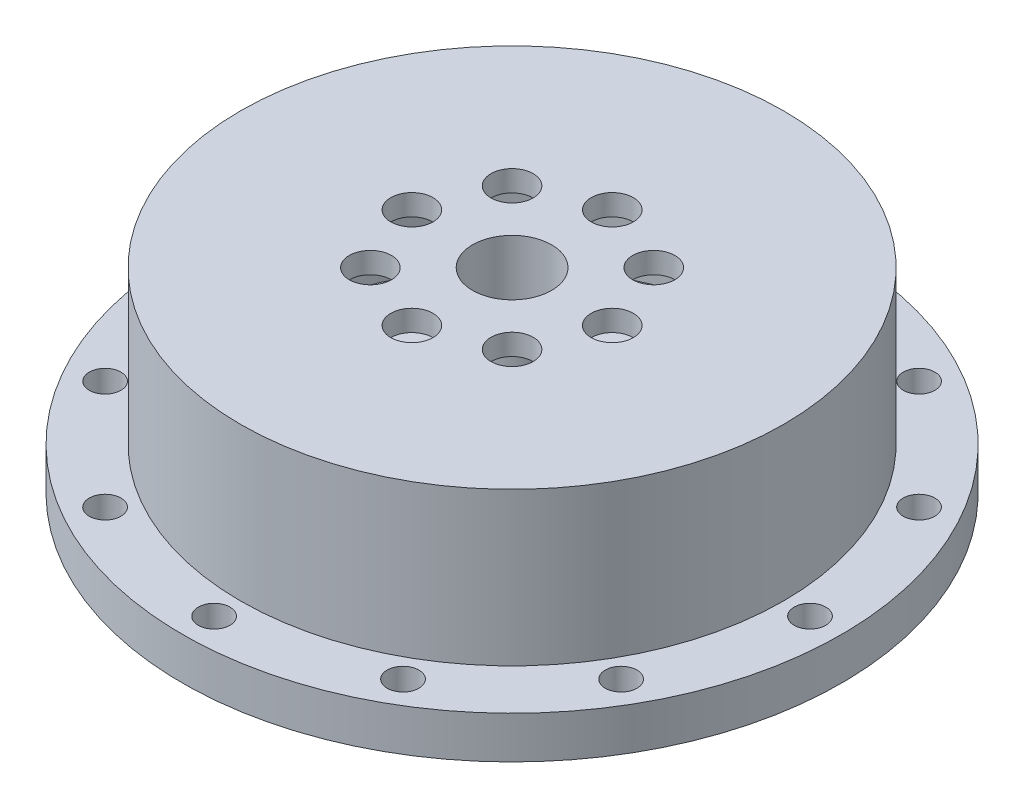
ISO-10303-21;
HEADER;
FILE_DESCRIPTION(('STEP AP214'),'2;1');
FILE_NAME('part.step','',(''),(''),'','','');
FILE_SCHEMA(('AUTOMOTIVE_DESIGN { 1 0 10303 214 1 1 1 1 }'));
ENDSEC;
DATA;
#1=APPLICATION_CONTEXT('core data for automotive mechanical design processes');
#2=APPLICATION_PROTOCOL_DEFINITION('international standard','automotive_design',2000,#1);
#3=PRODUCT_CONTEXT('',#1,'mechanical');
#4=PRODUCT('Part','Part','',(#3));
#5=PRODUCT_RELATED_PRODUCT_CATEGORY('part','',(#4));
#6=PRODUCT_DEFINITION_FORMATION('','',#4);
#7=PRODUCT_DEFINITION_CONTEXT('part definition',#1,'design');
#8=PRODUCT_DEFINITION('design','',#6,#7);
#9=PRODUCT_DEFINITION_SHAPE('','',#8);
#10=(LENGTH_UNIT() NAMED_UNIT(*) SI_UNIT(.MILLI.,.METRE.));
#11=(NAMED_UNIT(*) PLANE_ANGLE_UNIT() SI_UNIT($,.RADIAN.));
#12=(NAMED_UNIT(*) SI_UNIT($,.STERADIAN.) SOLID_ANGLE_UNIT());
#13=UNCERTAINTY_MEASURE_WITH_UNIT(LENGTH_MEASURE(1.E-05),#10,'distance_accuracy_value','');
#14=(GEOMETRIC_REPRESENTATION_CONTEXT(3) GLOBAL_UNCERTAINTY_ASSIGNED_CONTEXT((#13)) GLOBAL_UNIT_ASSIGNED_CONTEXT((#10,
#11,#12)) REPRESENTATION_CONTEXT('',''));
#15=CARTESIAN_POINT('',(0.,0.,0.));
#16=DIRECTION('',(0.,0.,1.));
#17=DIRECTION('',(1.,0.,0.));
#18=AXIS2_PLACEMENT_3D('',#15,#16,#17);
#19=CARTESIAN_POINT('',(7.5,32.2161096228833,0.));
#20=DIRECTION('',(0.,-1.,0.));
#21=DIRECTION('',(0.,0.,-1.));
#22=AXIS2_PLACEMENT_3D('',#19,#20,#21);
#23=PLANE('',#22);
#24=CARTESIAN_POINT('',(0.,32.2161096228833,0.));
#25=DIRECTION('',(0.,-1.,0.));
#26=DIRECTION('',(0.,0.,-1.));
#27=AXIS2_PLACEMENT_3D('',#24,#25,#26);
#28=CIRCLE('',#27,10.5);
#29=CARTESIAN_POINT('',(0.,32.2161096228833,-10.5));
#30=VERTEX_POINT('',#29);
#31=EDGE_CURVE('E11',#30,#30,#28,.T.);
#32=ORIENTED_EDGE('',*,*,#31,.T.);
#33=EDGE_LOOP('',(#32));
#34=FACE_BOUND('',#33,.T.);
#35=CARTESIAN_POINT('',(0.,32.2161096228833,0.));
#36=DIRECTION('',(0.,-1.,0.));
#37=DIRECTION('',(0.,0.,-1.));
#38=AXIS2_PLACEMENT_3D('',#35,#36,#37);
#39=CIRCLE('',#38,7.5);
#40=CARTESIAN_POINT('',(0.,32.2161096228833,-7.5));
#41=VERTEX_POINT('',#40);
#42=EDGE_CURVE('E232',#41,#41,#39,.T.);
#43=ORIENTED_EDGE('',*,*,#42,.F.);
#44=EDGE_LOOP('',(#43));
#45=FACE_BOUND('',#44,.T.);
#46=ADVANCED_FACE('F38',(#34,#45),#23,.T.);
#47=CARTESIAN_POINT('',(0.,0.,0.));
#48=DIRECTION('',(0.,-1.,0.));
#49=DIRECTION('',(0.,0.,-1.));
#50=AXIS2_PLACEMENT_3D('',#47,#48,#49);
#51=CYLINDRICAL_SURFACE('',#50,10.5);
#52=CARTESIAN_POINT('',(0.,39.2161096228833,0.));
#53=DIRECTION('',(0.,-1.,0.));
#54=DIRECTION('',(0.,0.,-1.));
#55=AXIS2_PLACEMENT_3D('',#52,#53,#54);
#56=CIRCLE('',#55,10.5);
#57=CARTESIAN_POINT('',(0.,39.2161096228833,-10.5));
#58=VERTEX_POINT('',#57);
#59=EDGE_CURVE('E45',#58,#58,#56,.T.);
#60=ORIENTED_EDGE('',*,*,#59,.T.);
#61=EDGE_LOOP('',(#60));
#62=FACE_BOUND('',#61,.T.);
#63=ORIENTED_EDGE('',*,*,#31,.F.);
#64=EDGE_LOOP('',(#63));
#65=FACE_BOUND('',#64,.T.);
#66=ADVANCED_FACE('F279',(#62,#65),#51,.T.);
#67=CARTESIAN_POINT('',(10.5,39.2161096228833,0.));
#68=DIRECTION('',(0.,-1.,0.));
#69=DIRECTION('',(0.,0.,-1.));
#70=AXIS2_PLACEMENT_3D('',#67,#68,#69);
#71=PLANE('',#70);
#72=CARTESIAN_POINT('',(13.4350288425444,39.2161096228833,-13.4350288425444));
#73=DIRECTION('',(0.,-1.,0.));
#74=DIRECTION('',(0.,0.,-1.));
#75=AXIS2_PLACEMENT_3D('',#72,#73,#74);
#76=CIRCLE('',#75,4.);
#77=CARTESIAN_POINT('',(13.4350288425444,39.2161096228833,-17.4350288425444));
#78=VERTEX_POINT('',#77);
#79=EDGE_CURVE('E157',#78,#78,#76,.T.);
#80=ORIENTED_EDGE('',*,*,#79,.F.);
#81=EDGE_LOOP('',(#80));
#82=FACE_BOUND('',#81,.T.);
#83=CARTESIAN_POINT('',(0.,39.2161096228833,-19.));
#84=DIRECTION('',(0.,-1.,0.));
#85=DIRECTION('',(0.,0.,-1.));
#86=AXIS2_PLACEMENT_3D('',#83,#84,#85);
#87=CIRCLE('',#86,4.);
#88=CARTESIAN_POINT('',(0.,39.2161096228833,-23.));
#89=VERTEX_POINT('',#88);
#90=EDGE_CURVE('E154',#89,#89,#87,.T.);
#91=ORIENTED_EDGE('',*,*,#90,.F.);
#92=EDGE_LOOP('',(#91));
#93=FACE_BOUND('',#92,.T.);
#94=CARTESIAN_POINT('',(-13.4350288425444,39.2161096228833,-13.4350288425444));
#95=DIRECTION('',(0.,-1.,0.));
#96=DIRECTION('',(0.,0.,-1.));
#97=AXIS2_PLACEMENT_3D('',#94,#95,#96);
#98=CIRCLE('',#97,4.);
#99=CARTESIAN_POINT('',(-13.4350288425444,39.2161096228833,-17.4350288425444));
#100=VERTEX_POINT('',#99);
#101=EDGE_CURVE('E151',#100,#100,#98,.T.);
#102=ORIENTED_EDGE('',*,*,#101,.F.);
#103=EDGE_LOOP('',(#102));
#104=FACE_BOUND('',#103,.T.);
#105=CARTESIAN_POINT('',(-19.,39.2161096228833,0.));
#106=DIRECTION('',(0.,-1.,0.));
#107=DIRECTION('',(0.,0.,-1.));
#108=AXIS2_PLACEMENT_3D('',#105,#106,#107);
#109=CIRCLE('',#108,4.);
#110=CARTESIAN_POINT('',(-19.,39.2161096228833,-4.));
#111=VERTEX_POINT('',#110);
#112=EDGE_CURVE('E148',#111,#111,#109,.T.);
#113=ORIENTED_EDGE('',*,*,#112,.F.);
#114=EDGE_LOOP('',(#113));
#115=FACE_BOUND('',#114,.T.);
#116=CARTESIAN_POINT('',(-13.4350288425444,39.2161096228833,13.4350288425444));
#117=DIRECTION('',(0.,-1.,0.));
#118=DIRECTION('',(0.,0.,-1.));
#119=AXIS2_PLACEMENT_3D('',#116,#117,#118);
#120=CIRCLE('',#119,4.);
#121=CARTESIAN_POINT('',(-13.4350288425444,39.2161096228833,9.4350288425444));
#122=VERTEX_POINT('',#121);
#123=EDGE_CURVE('E145',#122,#122,#120,.T.);
#124=ORIENTED_EDGE('',*,*,#123,.F.);
#125=EDGE_LOOP('',(#124));
#126=FACE_BOUND('',#125,.T.);
#127=CARTESIAN_POINT('',(0.,39.2161096228833,19.));
#128=DIRECTION('',(0.,-1.,0.));
#129=DIRECTION('',(0.,0.,-1.));
#130=AXIS2_PLACEMENT_3D('',#127,#128,#129);
#131=CIRCLE('',#130,4.);
#132=CARTESIAN_POINT('',(0.,39.2161096228833,15.));
#133=VERTEX_POINT('',#132);
#134=EDGE_CURVE('E142',#133,#133,#131,.T.);
#135=ORIENTED_EDGE('',*,*,#134,.F.);
#136=EDGE_LOOP('',(#135));
#137=FACE_BOUND('',#136,.T.);
#138=CARTESIAN_POINT('',(13.4350288425444,39.2161096228833,13.4350288425444));
#139=DIRECTION('',(0.,-1.,0.));
#140=DIRECTION('',(0.,0.,-1.));
#141=AXIS2_PLACEMENT_3D('',#138,#139,#140);
#142=CIRCLE('',#141,4.);
#143=CARTESIAN_POINT('',(13.4350288425444,39.2161096228833,9.43502884254441));
#144=VERTEX_POINT('',#143);
#145=EDGE_CURVE('E139',#144,#144,#142,.T.);
#146=ORIENTED_EDGE('',*,*,#145,.F.);
#147=EDGE_LOOP('',(#146));
#148=FACE_BOUND('',#147,.T.);
#149=CARTESIAN_POINT('',(19.,39.2161096228833,0.));
#150=DIRECTION('',(0.,-1.,0.));
#151=DIRECTION('',(0.,0.,-1.));
#152=AXIS2_PLACEMENT_3D('',#149,#150,#151);
#153=CIRCLE('',#152,4.);
#154=CARTESIAN_POINT('',(19.,39.2161096228833,-4.));
#155=VERTEX_POINT('',#154);
#156=EDGE_CURVE('E136',#155,#155,#153,.T.);
#157=ORIENTED_EDGE('',*,*,#156,.F.);
#158=EDGE_LOOP('',(#157));
#159=FACE_BOUND('',#158,.T.);
#160=CARTESIAN_POINT('',(0.,39.2161096228833,0.));
#161=DIRECTION('',(0.,-1.,0.));
#162=DIRECTION('',(0.,0.,-1.));
#163=AXIS2_PLACEMENT_3D('',#160,#161,#162);
#164=CIRCLE('',#163,48.);
#165=CARTESIAN_POINT('',(0.,39.2161096228833,-48.));
#166=VERTEX_POINT('',#165);
#167=EDGE_CURVE('E274',#166,#166,#164,.T.);
#168=ORIENTED_EDGE('',*,*,#167,.T.);
#169=EDGE_LOOP('',(#168));
#170=FACE_BOUND('',#169,.T.);
#171=ORIENTED_EDGE('',*,*,#59,.F.);
#172=EDGE_LOOP('',(#171));
#173=FACE_BOUND('',#172,.T.);
#174=ADVANCED_FACE('F282',(#82,#93,#104,#115,#126,#137,#148,#159,#170,#173),#71,.T.);
#175=CARTESIAN_POINT('',(0.,0.,0.));
#176=DIRECTION('',(0.,-1.,0.));
#177=DIRECTION('',(0.,0.,-1.));
#178=AXIS2_PLACEMENT_3D('',#175,#176,#177);
#179=CYLINDRICAL_SURFACE('',#178,48.);
#180=CARTESIAN_POINT('',(0.,9.21610962288333,0.));
#181=DIRECTION('',(0.,-1.,0.));
#182=DIRECTION('',(0.,0.,-1.));
#183=AXIS2_PLACEMENT_3D('',#180,#181,#182);
#184=CIRCLE('',#183,48.);
#185=CARTESIAN_POINT('',(0.,9.21610962288333,-48.));
#186=VERTEX_POINT('',#185);
#187=EDGE_CURVE('E271',#186,#186,#184,.T.);
#188=ORIENTED_EDGE('',*,*,#187,.T.);
#189=EDGE_LOOP('',(#188));
#190=FACE_BOUND('',#189,.T.);
#191=ORIENTED_EDGE('',*,*,#167,.F.);
#192=EDGE_LOOP('',(#191));
#193=FACE_BOUND('',#192,.T.);
#194=ADVANCED_FACE('F284',(#190,#193),#179,.F.);
#195=CARTESIAN_POINT('',(48.,9.21610962288333,0.));
#196=DIRECTION('',(0.,1.,0.));
#197=DIRECTION('',(0.,0.,1.));
#198=AXIS2_PLACEMENT_3D('',#195,#196,#197);
#199=PLANE('',#198);
#200=CARTESIAN_POINT('',(0.,9.21610962288333,0.));
#201=DIRECTION('',(0.,-1.,0.));
#202=DIRECTION('',(0.,0.,-1.));
#203=AXIS2_PLACEMENT_3D('',#200,#201,#202);
#204=CIRCLE('',#203,7.5);
#205=CARTESIAN_POINT('',(-1.00000000000039,9.21610962288333,7.4330343736592));
#206=VERTEX_POINT('',#205);
#207=CARTESIAN_POINT('',(0.999999999999613,9.21610962288333,7.4330343736593));
#208=VERTEX_POINT('',#207);
#209=EDGE_CURVE('E85',#206,#208,#204,.T.);
#210=ORIENTED_EDGE('',*,*,#209,.T.);
#211=DIRECTION('',(0.,0.,1.));
#212=VECTOR('',#211,1.);
#213=CARTESIAN_POINT('',(0.999999999999613,9.21610962288333,9.00000000000054));
#214=LINE('',#213,#212);
#215=CARTESIAN_POINT('',(0.999999999999613,9.21610962288333,6.00000000000054));
#216=VERTEX_POINT('',#215);
#217=EDGE_CURVE('E77',#216,#208,#214,.T.);
#218=ORIENTED_EDGE('',*,*,#217,.F.);
#219=DIRECTION('',(1.,0.,0.));
#220=VECTOR('',#219,1.);
#221=CARTESIAN_POINT('',(0.999999999999613,9.21610962288333,6.00000000000054));
#222=LINE('',#221,#220);
#223=CARTESIAN_POINT('',(-1.00000000000039,9.21610962288333,6.00000000000054));
#224=VERTEX_POINT('',#223);
#225=EDGE_CURVE('E83',#224,#216,#222,.T.);
#226=ORIENTED_EDGE('',*,*,#225,.F.);
#227=DIRECTION('',(0.,0.,-1.));
#228=VECTOR('',#227,1.);
#229=CARTESIAN_POINT('',(-1.00000000000039,9.21610962288333,9.00000000000054));
#230=LINE('',#229,#228);
#231=EDGE_CURVE('E87',#206,#224,#230,.T.);
#232=ORIENTED_EDGE('',*,*,#231,.F.);
#233=EDGE_LOOP('',(#210,#218,#226,#232));
#234=FACE_BOUND('',#233,.T.);
#235=ORIENTED_EDGE('',*,*,#187,.F.);
#236=EDGE_LOOP('',(#235));
#237=FACE_BOUND('',#236,.T.);
#238=ADVANCED_FACE('F79',(#234,#237),#199,.T.);
#239=CARTESIAN_POINT('',(0.,0.,0.));
#240=DIRECTION('',(0.,-1.,0.));
#241=DIRECTION('',(0.,0.,-1.));
#242=AXIS2_PLACEMENT_3D('',#239,#240,#241);
#243=CYLINDRICAL_SURFACE('',#242,7.5);
#244=DIRECTION('',(0.,-1.,0.));
#245=VECTOR('',#244,1.);
#246=CARTESIAN_POINT('',(0.999999999999613,0.,7.4330343736593));
#247=LINE('',#246,#245);
#248=CARTESIAN_POINT('',(0.999999999999612,3.21610962288333,7.4330343736593));
#249=VERTEX_POINT('',#248);
#250=EDGE_CURVE('E52',#208,#249,#247,.T.);
#251=ORIENTED_EDGE('',*,*,#250,.F.);
#252=ORIENTED_EDGE('',*,*,#209,.F.);
#253=DIRECTION('',(0.,-1.,0.));
#254=VECTOR('',#253,1.);
#255=CARTESIAN_POINT('',(-1.00000000000039,0.,7.4330343736592));
#256=LINE('',#255,#254);
#257=CARTESIAN_POINT('',(-1.00000000000039,3.21610962288333,7.4330343736592));
#258=VERTEX_POINT('',#257);
#259=EDGE_CURVE('E57',#258,#206,#256,.F.);
#260=ORIENTED_EDGE('',*,*,#259,.F.);
#261=CARTESIAN_POINT('',(0.,3.21610962288333,0.));
#262=DIRECTION('',(0.,-1.,0.));
#263=DIRECTION('',(0.,0.,-1.));
#264=AXIS2_PLACEMENT_3D('',#261,#262,#263);
#265=CIRCLE('',#264,7.5);
#266=EDGE_CURVE('E268',#258,#249,#265,.T.);
#267=ORIENTED_EDGE('',*,*,#266,.T.);
#268=EDGE_LOOP('',(#251,#252,#260,#267));
#269=FACE_BOUND('',#268,.T.);
#270=ADVANCED_FACE('F375',(#269),#243,.F.);
#271=CARTESIAN_POINT('',(10.,3.21610962288333,0.));
#272=DIRECTION('',(0.,-1.,0.));
#273=DIRECTION('',(0.,0.,-1.));
#274=AXIS2_PLACEMENT_3D('',#271,#272,#273);
#275=PLANE('',#274);
#276=ORIENTED_EDGE('',*,*,#266,.F.);
#277=DIRECTION('',(0.,0.,-1.));
#278=VECTOR('',#277,1.);
#279=CARTESIAN_POINT('',(-1.00000000000039,3.21610962288333,9.00000000000054));
#280=LINE('',#279,#278);
#281=CARTESIAN_POINT('',(-1.00000000000039,3.21610962288333,6.00000000000054));
#282=VERTEX_POINT('',#281);
#283=EDGE_CURVE('E106',#258,#282,#280,.T.);
#284=ORIENTED_EDGE('',*,*,#283,.T.);
#285=DIRECTION('',(1.,0.,0.));
#286=VECTOR('',#285,1.);
#287=CARTESIAN_POINT('',(0.999999999999613,3.21610962288333,6.00000000000054));
#288=LINE('',#287,#286);
#289=CARTESIAN_POINT('',(0.999999999999613,3.21610962288333,6.00000000000054));
#290=VERTEX_POINT('',#289);
#291=EDGE_CURVE('E102',#282,#290,#288,.T.);
#292=ORIENTED_EDGE('',*,*,#291,.T.);
#293=DIRECTION('',(0.,0.,1.));
#294=VECTOR('',#293,1.);
#295=CARTESIAN_POINT('',(0.999999999999613,3.21610962288333,9.00000000000054));
#296=LINE('',#295,#294);
#297=EDGE_CURVE('E93',#290,#249,#296,.T.);
#298=ORIENTED_EDGE('',*,*,#297,.T.);
#299=EDGE_LOOP('',(#276,#284,#292,#298));
#300=FACE_BOUND('',#299,.T.);
#301=CARTESIAN_POINT('',(0.,3.21610962288333,0.));
#302=DIRECTION('',(0.,-1.,0.));
#303=DIRECTION('',(0.,0.,-1.));
#304=AXIS2_PLACEMENT_3D('',#301,#302,#303);
#305=CIRCLE('',#304,10.);
#306=CARTESIAN_POINT('',(0.,3.21610962288333,-10.));
#307=VERTEX_POINT('',#306);
#308=EDGE_CURVE('E265',#307,#307,#305,.T.);
#309=ORIENTED_EDGE('',*,*,#308,.T.);
#310=EDGE_LOOP('',(#309));
#311=FACE_BOUND('',#310,.T.);
#312=ADVANCED_FACE('F370',(#300,#311),#275,.T.);
#313=CARTESIAN_POINT('',(0.,0.,0.));
#314=DIRECTION('',(0.,-1.,0.));
#315=DIRECTION('',(0.,0.,-1.));
#316=AXIS2_PLACEMENT_3D('',#313,#314,#315);
#317=CYLINDRICAL_SURFACE('',#316,10.);
#318=CARTESIAN_POINT('',(0.,6.21610962288333,0.));
#319=DIRECTION('',(0.,-1.,0.));
#320=DIRECTION('',(0.,0.,-1.));
#321=AXIS2_PLACEMENT_3D('',#318,#319,#320);
#322=CIRCLE('',#321,10.);
#323=CARTESIAN_POINT('',(0.,6.21610962288333,-10.));
#324=VERTEX_POINT('',#323);
#325=EDGE_CURVE('E262',#324,#324,#322,.T.);
#326=ORIENTED_EDGE('',*,*,#325,.T.);
#327=EDGE_LOOP('',(#326));
#328=FACE_BOUND('',#327,.T.);
#329=ORIENTED_EDGE('',*,*,#308,.F.);
#330=EDGE_LOOP('',(#329));
#331=FACE_BOUND('',#330,.T.);
#332=ADVANCED_FACE('F364',(#328,#331),#317,.T.);
#333=CARTESIAN_POINT('',(36.,6.21610962288334,0.));
#334=DIRECTION('',(0.,-1.,0.));
#335=DIRECTION('',(0.,0.,-1.));
#336=AXIS2_PLACEMENT_3D('',#333,#334,#335);
#337=PLANE('',#336);
#338=CARTESIAN_POINT('',(0.,6.21610962288334,0.));
#339=DIRECTION('',(0.,-1.,0.));
#340=DIRECTION('',(0.,0.,-1.));
#341=AXIS2_PLACEMENT_3D('',#338,#339,#340);
#342=CIRCLE('',#341,36.);
#343=CARTESIAN_POINT('',(0.,6.21610962288334,-36.));
#344=VERTEX_POINT('',#343);
#345=EDGE_CURVE('E259',#344,#344,#342,.T.);
#346=ORIENTED_EDGE('',*,*,#345,.T.);
#347=EDGE_LOOP('',(#346));
#348=FACE_BOUND('',#347,.T.);
#349=ORIENTED_EDGE('',*,*,#325,.F.);
#350=EDGE_LOOP('',(#349));
#351=FACE_BOUND('',#350,.T.);
#352=ADVANCED_FACE('F358',(#348,#351),#337,.T.);
#353=CARTESIAN_POINT('',(0.,0.,0.));
#354=DIRECTION('',(0.,-1.,0.));
#355=DIRECTION('',(0.,0.,-1.));
#356=AXIS2_PLACEMENT_3D('',#353,#354,#355);
#357=CYLINDRICAL_SURFACE('',#356,36.);
#358=CARTESIAN_POINT('',(0.,4.21610962288333,0.));
#359=DIRECTION('',(0.,-1.,0.));
#360=DIRECTION('',(0.,0.,-1.));
#361=AXIS2_PLACEMENT_3D('',#358,#359,#360);
#362=CIRCLE('',#361,36.);
#363=CARTESIAN_POINT('',(0.,4.21610962288333,-36.));
#364=VERTEX_POINT('',#363);
#365=EDGE_CURVE('E256',#364,#364,#362,.T.);
#366=ORIENTED_EDGE('',*,*,#365,.T.);
#367=EDGE_LOOP('',(#366));
#368=FACE_BOUND('',#367,.T.);
#369=ORIENTED_EDGE('',*,*,#345,.F.);
#370=EDGE_LOOP('',(#369));
#371=FACE_BOUND('',#370,.T.);
#372=ADVANCED_FACE('F352',(#368,#371),#357,.F.);
#373=CARTESIAN_POINT('',(36.,4.21610962288333,0.));
#374=DIRECTION('',(0.,-1.,0.));
#375=DIRECTION('',(0.,0.,-1.));
#376=AXIS2_PLACEMENT_3D('',#373,#374,#375);
#377=PLANE('',#376);
#378=CARTESIAN_POINT('',(0.,4.21610962288333,0.));
#379=DIRECTION('',(0.,-1.,0.));
#380=DIRECTION('',(0.,0.,-1.));
#381=AXIS2_PLACEMENT_3D('',#378,#379,#380);
#382=CIRCLE('',#381,39.);
#383=CARTESIAN_POINT('',(0.,4.21610962288333,-39.));
#384=VERTEX_POINT('',#383);
#385=EDGE_CURVE('E253',#384,#384,#382,.T.);
#386=ORIENTED_EDGE('',*,*,#385,.T.);
#387=EDGE_LOOP('',(#386));
#388=FACE_BOUND('',#387,.T.);
#389=ORIENTED_EDGE('',*,*,#365,.F.);
#390=EDGE_LOOP('',(#389));
#391=FACE_BOUND('',#390,.T.);
#392=ADVANCED_FACE('F346',(#388,#391),#377,.T.);
#393=CARTESIAN_POINT('',(0.,0.,0.));
#394=DIRECTION('',(0.,-1.,0.));
#395=DIRECTION('',(0.,0.,-1.));
#396=AXIS2_PLACEMENT_3D('',#393,#394,#395);
#397=CYLINDRICAL_SURFACE('',#396,39.);
#398=CARTESIAN_POINT('',(0.,6.21610962288334,0.));
#399=DIRECTION('',(0.,-1.,0.));
#400=DIRECTION('',(0.,0.,-1.));
#401=AXIS2_PLACEMENT_3D('',#398,#399,#400);
#402=CIRCLE('',#401,39.);
#403=CARTESIAN_POINT('',(0.,6.21610962288334,-39.));
#404=VERTEX_POINT('',#403);
#405=EDGE_CURVE('E250',#404,#404,#402,.T.);
#406=ORIENTED_EDGE('',*,*,#405,.T.);
#407=EDGE_LOOP('',(#406));
#408=FACE_BOUND('',#407,.T.);
#409=ORIENTED_EDGE('',*,*,#385,.F.);
#410=EDGE_LOOP('',(#409));
#411=FACE_BOUND('',#410,.T.);
#412=ADVANCED_FACE('F339',(#408,#411),#397,.T.);
#413=CARTESIAN_POINT('',(62.5,6.21610962288334,0.));
#414=DIRECTION('',(0.,-1.,0.));
#415=DIRECTION('',(0.,0.,-1.));
#416=AXIS2_PLACEMENT_3D('',#413,#414,#415);
#417=PLANE('',#416);
#418=CARTESIAN_POINT('',(56.5,6.21610962288334,0.));
#419=DIRECTION('',(0.,-1.,0.));
#420=DIRECTION('',(0.,0.,-1.));
#421=AXIS2_PLACEMENT_3D('',#418,#419,#420);
#422=CIRCLE('',#421,3.);
#423=CARTESIAN_POINT('',(56.5,6.21610962288334,-3.));
#424=VERTEX_POINT('',#423);
#425=EDGE_CURVE('E229',#424,#424,#422,.T.);
#426=ORIENTED_EDGE('',*,*,#425,.F.);
#427=EDGE_LOOP('',(#426));
#428=FACE_BOUND('',#427,.T.);
#429=CARTESIAN_POINT('',(48.9304353138211,6.21610962288334,-28.2499999999994));
#430=DIRECTION('',(0.,-1.,0.));
#431=DIRECTION('',(0.,0.,-1.));
#432=AXIS2_PLACEMENT_3D('',#429,#430,#431);
#433=CIRCLE('',#432,3.00000000000001);
#434=CARTESIAN_POINT('',(48.9304353138211,6.21610962288334,-31.2499999999994));
#435=VERTEX_POINT('',#434);
#436=EDGE_CURVE('E226',#435,#435,#433,.T.);
#437=ORIENTED_EDGE('',*,*,#436,.F.);
#438=EDGE_LOOP('',(#437));
#439=FACE_BOUND('',#438,.T.);
#440=CARTESIAN_POINT('',(28.2500000000006,6.21610962288334,-48.9304353138205));
#441=DIRECTION('',(0.,-1.,0.));
#442=DIRECTION('',(0.,0.,-1.));
#443=AXIS2_PLACEMENT_3D('',#440,#441,#442);
#444=CIRCLE('',#443,3.00000000000001);
#445=CARTESIAN_POINT('',(28.2500000000006,6.21610962288334,-51.9304353138205));
#446=VERTEX_POINT('',#445);
#447=EDGE_CURVE('E223',#446,#446,#444,.T.);
#448=ORIENTED_EDGE('',*,*,#447,.F.);
#449=EDGE_LOOP('',(#448));
#450=FACE_BOUND('',#449,.T.);
#451=CARTESIAN_POINT('',(5.91806086933911E-13,6.21610962288334,-56.5));
#452=DIRECTION('',(0.,-1.,0.));
#453=DIRECTION('',(0.,0.,-1.));
#454=AXIS2_PLACEMENT_3D('',#451,#452,#453);
#455=CIRCLE('',#454,3.);
#456=CARTESIAN_POINT('',(5.91806086933911E-13,6.21610962288334,-59.5));
#457=VERTEX_POINT('',#456);
#458=EDGE_CURVE('E220',#457,#457,#455,.T.);
#459=ORIENTED_EDGE('',*,*,#458,.F.);
#460=EDGE_LOOP('',(#459));
#461=FACE_BOUND('',#460,.T.);
#462=CARTESIAN_POINT('',(48.9304353138207,6.21610962288334,28.2500000000001));
#463=DIRECTION('',(0.,-1.,0.));
#464=DIRECTION('',(0.,0.,-1.));
#465=AXIS2_PLACEMENT_3D('',#462,#463,#464);
#466=CIRCLE('',#465,3.);
#467=CARTESIAN_POINT('',(48.9304353138207,6.21610962288334,25.2500000000001));
#468=VERTEX_POINT('',#467);
#469=EDGE_CURVE('E217',#468,#468,#466,.T.);
#470=ORIENTED_EDGE('',*,*,#469,.F.);
#471=EDGE_LOOP('',(#470));
#472=FACE_BOUND('',#471,.T.);
#473=CARTESIAN_POINT('',(28.2499999999999,6.21610962288334,48.9304353138209));
#474=DIRECTION('',(0.,-1.,0.));
#475=DIRECTION('',(0.,0.,-1.));
#476=AXIS2_PLACEMENT_3D('',#473,#474,#475);
#477=CIRCLE('',#476,3.);
#478=CARTESIAN_POINT('',(28.2499999999999,6.21610962288334,45.9304353138209));
#479=VERTEX_POINT('',#478);
#480=EDGE_CURVE('E214',#479,#479,#477,.T.);
#481=ORIENTED_EDGE('',*,*,#480,.F.);
#482=EDGE_LOOP('',(#481));
#483=FACE_BOUND('',#482,.T.);
#484=CARTESIAN_POINT('',(-1.97268695644637E-13,6.21610962288334,56.5));
#485=DIRECTION('',(0.,-1.,0.));
#486=DIRECTION('',(0.,0.,-1.));
#487=AXIS2_PLACEMENT_3D('',#484,#485,#486);
#488=CIRCLE('',#487,3.);
#489=CARTESIAN_POINT('',(-1.97268695644637E-13,6.21610962288334,53.5));
#490=VERTEX_POINT('',#489);
#491=EDGE_CURVE('E211',#490,#490,#488,.T.);
#492=ORIENTED_EDGE('',*,*,#491,.F.);
#493=EDGE_LOOP('',(#492));
#494=FACE_BOUND('',#493,.T.);
#495=CARTESIAN_POINT('',(-28.2500000000002,6.21610962288334,48.9304353138206));
#496=DIRECTION('',(0.,-1.,0.));
#497=DIRECTION('',(0.,0.,-1.));
#498=AXIS2_PLACEMENT_3D('',#495,#496,#497);
#499=CIRCLE('',#498,2.99999999999999);
#500=CARTESIAN_POINT('',(-28.2500000000002,6.21610962288334,45.9304353138206));
#501=VERTEX_POINT('',#500);
#502=EDGE_CURVE('E208',#501,#501,#499,.T.);
#503=ORIENTED_EDGE('',*,*,#502,.F.);
#504=EDGE_LOOP('',(#503));
#505=FACE_BOUND('',#504,.T.);
#506=CARTESIAN_POINT('',(-48.9304353138209,6.21610962288334,28.2499999999997));
#507=DIRECTION('',(0.,-1.,0.));
#508=DIRECTION('',(0.,0.,-1.));
#509=AXIS2_PLACEMENT_3D('',#506,#507,#508);
#510=CIRCLE('',#509,3.);
#511=CARTESIAN_POINT('',(-48.9304353138209,6.21610962288334,25.2499999999997));
#512=VERTEX_POINT('',#511);
#513=EDGE_CURVE('E205',#512,#512,#510,.T.);
#514=ORIENTED_EDGE('',*,*,#513,.F.);
#515=EDGE_LOOP('',(#514));
#516=FACE_BOUND('',#515,.T.);
#517=CARTESIAN_POINT('',(-56.5,6.21610962288334,-3.94537391289274E-13));
#518=DIRECTION('',(0.,-1.,0.));
#519=DIRECTION('',(0.,0.,-1.));
#520=AXIS2_PLACEMENT_3D('',#517,#518,#519);
#521=CIRCLE('',#520,3.);
#522=CARTESIAN_POINT('',(-56.5,6.21610962288334,-3.0000000000004));
#523=VERTEX_POINT('',#522);
#524=EDGE_CURVE('E202',#523,#523,#521,.T.);
#525=ORIENTED_EDGE('',*,*,#524,.F.);
#526=EDGE_LOOP('',(#525));
#527=FACE_BOUND('',#526,.T.);
#528=CARTESIAN_POINT('',(-48.9304353138205,6.21610962288334,-28.2500000000004));
#529=DIRECTION('',(0.,-1.,0.));
#530=DIRECTION('',(0.,0.,-1.));
#531=AXIS2_PLACEMENT_3D('',#528,#529,#530);
#532=CIRCLE('',#531,3.);
#533=CARTESIAN_POINT('',(-48.9304353138205,6.21610962288334,-31.2500000000004));
#534=VERTEX_POINT('',#533);
#535=EDGE_CURVE('E199',#534,#534,#532,.T.);
#536=ORIENTED_EDGE('',*,*,#535,.F.);
#537=EDGE_LOOP('',(#536));
#538=FACE_BOUND('',#537,.T.);
#539=CARTESIAN_POINT('',(-28.2499999999995,6.21610962288334,-48.930435313821));
#540=DIRECTION('',(0.,-1.,0.));
#541=DIRECTION('',(0.,0.,-1.));
#542=AXIS2_PLACEMENT_3D('',#539,#540,#541);
#543=CIRCLE('',#542,3.);
#544=CARTESIAN_POINT('',(-28.2499999999995,6.21610962288334,-51.930435313821));
#545=VERTEX_POINT('',#544);
#546=EDGE_CURVE('E164',#545,#545,#543,.T.);
#547=ORIENTED_EDGE('',*,*,#546,.F.);
#548=EDGE_LOOP('',(#547));
#549=FACE_BOUND('',#548,.T.);
#550=CARTESIAN_POINT('',(0.,6.21610962288334,0.));
#551=DIRECTION('',(0.,-1.,0.));
#552=DIRECTION('',(0.,0.,-1.));
#553=AXIS2_PLACEMENT_3D('',#550,#551,#552);
#554=CIRCLE('',#553,62.5);
#555=CARTESIAN_POINT('',(0.,6.21610962288334,-62.5));
#556=VERTEX_POINT('',#555);
#557=EDGE_CURVE('E247',#556,#556,#554,.T.);
#558=ORIENTED_EDGE('',*,*,#557,.T.);
#559=EDGE_LOOP('',(#558));
#560=FACE_BOUND('',#559,.T.);
#561=ORIENTED_EDGE('',*,*,#405,.F.);
#562=EDGE_LOOP('',(#561));
#563=FACE_BOUND('',#562,.T.);
#564=ADVANCED_FACE('F333',(#428,#439,#450,#461,#472,#483,#494,#505,#516,#527,#538,#549,#560,
#563),#417,.T.);
#565=CARTESIAN_POINT('',(0.,0.,0.));
#566=DIRECTION('',(0.,-1.,0.));
#567=DIRECTION('',(0.,0.,-1.));
#568=AXIS2_PLACEMENT_3D('',#565,#566,#567);
#569=CYLINDRICAL_SURFACE('',#568,62.5);
#570=CARTESIAN_POINT('',(0.,14.2161096228833,0.));
#571=DIRECTION('',(0.,-1.,0.));
#572=DIRECTION('',(0.,0.,-1.));
#573=AXIS2_PLACEMENT_3D('',#570,#571,#572);
#574=CIRCLE('',#573,62.5);
#575=CARTESIAN_POINT('',(0.,14.2161096228833,-62.5));
#576=VERTEX_POINT('',#575);
#577=EDGE_CURVE('E244',#576,#576,#574,.T.);
#578=ORIENTED_EDGE('',*,*,#577,.T.);
#579=EDGE_LOOP('',(#578));
#580=FACE_BOUND('',#579,.T.);
#581=ORIENTED_EDGE('',*,*,#557,.F.);
#582=EDGE_LOOP('',(#581));
#583=FACE_BOUND('',#582,.T.);
#584=ADVANCED_FACE('F326',(#580,#583),#569,.T.);
#585=CARTESIAN_POINT('',(51.5,14.2161096228833,0.));
#586=DIRECTION('',(0.,1.,0.));
#587=DIRECTION('',(0.,0.,1.));
#588=AXIS2_PLACEMENT_3D('',#585,#586,#587);
#589=PLANE('',#588);
#590=CARTESIAN_POINT('',(56.5,14.2161096228833,0.));
#591=DIRECTION('',(0.,1.,0.));
#592=DIRECTION('',(0.,0.,1.));
#593=AXIS2_PLACEMENT_3D('',#590,#591,#592);
#594=CIRCLE('',#593,3.);
#595=CARTESIAN_POINT('',(56.5,14.2161096228833,3.));
#596=VERTEX_POINT('',#595);
#597=EDGE_CURVE('E161',#596,#596,#594,.T.);
#598=ORIENTED_EDGE('',*,*,#597,.F.);
#599=EDGE_LOOP('',(#598));
#600=FACE_BOUND('',#599,.T.);
#601=CARTESIAN_POINT('',(48.9304353138211,14.2161096228833,-28.2499999999994));
#602=DIRECTION('',(0.,1.,0.));
#603=DIRECTION('',(0.,0.,1.));
#604=AXIS2_PLACEMENT_3D('',#601,#602,#603);
#605=CIRCLE('',#604,3.00000000000001);
#606=CARTESIAN_POINT('',(48.9304353138211,14.2161096228833,-25.2499999999994));
#607=VERTEX_POINT('',#606);
#608=EDGE_CURVE('E160',#607,#607,#605,.T.);
#609=ORIENTED_EDGE('',*,*,#608,.F.);
#610=EDGE_LOOP('',(#609));
#611=FACE_BOUND('',#610,.T.);
#612=CARTESIAN_POINT('',(28.2500000000006,14.2161096228833,-48.9304353138205));
#613=DIRECTION('',(0.,1.,0.));
#614=DIRECTION('',(0.,0.,1.));
#615=AXIS2_PLACEMENT_3D('',#612,#613,#614);
#616=CIRCLE('',#615,3.00000000000001);
#617=CARTESIAN_POINT('',(28.2500000000006,14.2161096228833,-45.9304353138204));
#618=VERTEX_POINT('',#617);
#619=EDGE_CURVE('E170',#618,#618,#616,.T.);
#620=ORIENTED_EDGE('',*,*,#619,.F.);
#621=EDGE_LOOP('',(#620));
#622=FACE_BOUND('',#621,.T.);
#623=CARTESIAN_POINT('',(5.91806086933911E-13,14.2161096228833,-56.5));
#624=DIRECTION('',(0.,1.,0.));
#625=DIRECTION('',(0.,0.,1.));
#626=AXIS2_PLACEMENT_3D('',#623,#624,#625);
#627=CIRCLE('',#626,3.);
#628=CARTESIAN_POINT('',(5.91806086933911E-13,14.2161096228833,-53.5));
#629=VERTEX_POINT('',#628);
#630=EDGE_CURVE('E166',#629,#629,#627,.T.);
#631=ORIENTED_EDGE('',*,*,#630,.F.);
#632=EDGE_LOOP('',(#631));
#633=FACE_BOUND('',#632,.T.);
#634=CARTESIAN_POINT('',(48.9304353138207,14.2161096228833,28.2500000000001));
#635=DIRECTION('',(0.,1.,0.));
#636=DIRECTION('',(0.,0.,1.));
#637=AXIS2_PLACEMENT_3D('',#634,#635,#636);
#638=CIRCLE('',#637,3.);
#639=CARTESIAN_POINT('',(48.9304353138207,14.2161096228833,31.2500000000001));
#640=VERTEX_POINT('',#639);
#641=EDGE_CURVE('E165',#640,#640,#638,.T.);
#642=ORIENTED_EDGE('',*,*,#641,.F.);
#643=EDGE_LOOP('',(#642));
#644=FACE_BOUND('',#643,.T.);
#645=CARTESIAN_POINT('',(28.2499999999999,14.2161096228833,48.9304353138209));
#646=DIRECTION('',(0.,1.,0.));
#647=DIRECTION('',(0.,0.,1.));
#648=AXIS2_PLACEMENT_3D('',#645,#646,#647);
#649=CIRCLE('',#648,3.);
#650=CARTESIAN_POINT('',(28.2499999999999,14.2161096228833,51.9304353138209));
#651=VERTEX_POINT('',#650);
#652=EDGE_CURVE('E189',#651,#651,#649,.T.);
#653=ORIENTED_EDGE('',*,*,#652,.F.);
#654=EDGE_LOOP('',(#653));
#655=FACE_BOUND('',#654,.T.);
#656=CARTESIAN_POINT('',(-1.97268695644637E-13,14.2161096228833,56.5));
#657=DIRECTION('',(0.,1.,0.));
#658=DIRECTION('',(0.,0.,1.));
#659=AXIS2_PLACEMENT_3D('',#656,#657,#658);
#660=CIRCLE('',#659,3.);
#661=CARTESIAN_POINT('',(-1.97268695644637E-13,14.2161096228833,59.5));
#662=VERTEX_POINT('',#661);
#663=EDGE_CURVE('E192',#662,#662,#660,.T.);
#664=ORIENTED_EDGE('',*,*,#663,.F.);
#665=EDGE_LOOP('',(#664));
#666=FACE_BOUND('',#665,.T.);
#667=CARTESIAN_POINT('',(-28.2500000000002,14.2161096228833,48.9304353138206));
#668=DIRECTION('',(0.,1.,0.));
#669=DIRECTION('',(0.,0.,1.));
#670=AXIS2_PLACEMENT_3D('',#667,#668,#669);
#671=CIRCLE('',#670,2.99999999999999);
#672=CARTESIAN_POINT('',(-28.2500000000002,14.2161096228833,51.9304353138206));
#673=VERTEX_POINT('',#672);
#674=EDGE_CURVE('E178',#673,#673,#671,.T.);
#675=ORIENTED_EDGE('',*,*,#674,.F.);
#676=EDGE_LOOP('',(#675));
#677=FACE_BOUND('',#676,.T.);
#678=CARTESIAN_POINT('',(-48.9304353138209,14.2161096228833,28.2499999999997));
#679=DIRECTION('',(0.,1.,0.));
#680=DIRECTION('',(0.,0.,1.));
#681=AXIS2_PLACEMENT_3D('',#678,#679,#680);
#682=CIRCLE('',#681,3.);
#683=CARTESIAN_POINT('',(-48.9304353138209,14.2161096228833,31.2499999999997));
#684=VERTEX_POINT('',#683);
#685=EDGE_CURVE('E175',#684,#684,#682,.T.);
#686=ORIENTED_EDGE('',*,*,#685,.F.);
#687=EDGE_LOOP('',(#686));
#688=FACE_BOUND('',#687,.T.);
#689=CARTESIAN_POINT('',(-56.5,14.2161096228833,-3.94537391289274E-13));
#690=DIRECTION('',(0.,1.,0.));
#691=DIRECTION('',(0.,0.,1.));
#692=AXIS2_PLACEMENT_3D('',#689,#690,#691);
#693=CIRCLE('',#692,3.);
#694=CARTESIAN_POINT('',(-56.5,14.2161096228833,2.99999999999961));
#695=VERTEX_POINT('',#694);
#696=EDGE_CURVE('E179',#695,#695,#693,.T.);
#697=ORIENTED_EDGE('',*,*,#696,.F.);
#698=EDGE_LOOP('',(#697));
#699=FACE_BOUND('',#698,.T.);
#700=CARTESIAN_POINT('',(-48.9304353138205,14.2161096228833,-28.2500000000004));
#701=DIRECTION('',(0.,1.,0.));
#702=DIRECTION('',(0.,0.,1.));
#703=AXIS2_PLACEMENT_3D('',#700,#701,#702);
#704=CIRCLE('',#703,3.);
#705=CARTESIAN_POINT('',(-48.9304353138205,14.2161096228833,-25.2500000000004));
#706=VERTEX_POINT('',#705);
#707=EDGE_CURVE('E182',#706,#706,#704,.T.);
#708=ORIENTED_EDGE('',*,*,#707,.F.);
#709=EDGE_LOOP('',(#708));
#710=FACE_BOUND('',#709,.T.);
#711=CARTESIAN_POINT('',(-28.2499999999995,14.2161096228833,-48.930435313821));
#712=DIRECTION('',(0.,1.,0.));
#713=DIRECTION('',(0.,0.,1.));
#714=AXIS2_PLACEMENT_3D('',#711,#712,#713);
#715=CIRCLE('',#714,3.);
#716=CARTESIAN_POINT('',(-28.2499999999995,14.2161096228833,-45.930435313821));
#717=VERTEX_POINT('',#716);
#718=EDGE_CURVE('E169',#717,#717,#715,.T.);
#719=ORIENTED_EDGE('',*,*,#718,.F.);
#720=EDGE_LOOP('',(#719));
#721=FACE_BOUND('',#720,.T.);
#722=CARTESIAN_POINT('',(0.,14.2161096228833,0.));
#723=DIRECTION('',(0.,-1.,0.));
#724=DIRECTION('',(0.,0.,-1.));
#725=AXIS2_PLACEMENT_3D('',#722,#723,#724);
#726=CIRCLE('',#725,51.5);
#727=CARTESIAN_POINT('',(0.,14.2161096228833,-51.5));
#728=VERTEX_POINT('',#727);
#729=EDGE_CURVE('E241',#728,#728,#726,.T.);
#730=ORIENTED_EDGE('',*,*,#729,.T.);
#731=EDGE_LOOP('',(#730));
#732=FACE_BOUND('',#731,.T.);
#733=ORIENTED_EDGE('',*,*,#577,.F.);
#734=EDGE_LOOP('',(#733));
#735=FACE_BOUND('',#734,.T.);
#736=ADVANCED_FACE('F320',(#600,#611,#622,#633,#644,#655,#666,#677,#688,#699,#710,#721,#732,
#735),#589,.T.);
#737=CARTESIAN_POINT('',(0.,0.,0.));
#738=DIRECTION('',(0.,-1.,0.));
#739=DIRECTION('',(0.,0.,-1.));
#740=AXIS2_PLACEMENT_3D('',#737,#738,#739);
#741=CYLINDRICAL_SURFACE('',#740,51.5);
#742=CARTESIAN_POINT('',(0.,43.2161096228833,0.));
#743=DIRECTION('',(0.,-1.,0.));
#744=DIRECTION('',(0.,0.,-1.));
#745=AXIS2_PLACEMENT_3D('',#742,#743,#744);
#746=CIRCLE('',#745,51.5);
#747=CARTESIAN_POINT('',(0.,43.2161096228833,-51.5));
#748=VERTEX_POINT('',#747);
#749=EDGE_CURVE('E238',#748,#748,#746,.T.);
#750=ORIENTED_EDGE('',*,*,#749,.T.);
#751=EDGE_LOOP('',(#750));
#752=FACE_BOUND('',#751,.T.);
#753=ORIENTED_EDGE('',*,*,#729,.F.);
#754=EDGE_LOOP('',(#753));
#755=FACE_BOUND('',#754,.T.);
#756=ADVANCED_FACE('F313',(#752,#755),#741,.T.);
#757=CARTESIAN_POINT('',(7.5,43.2161096228833,0.));
#758=DIRECTION('',(0.,1.,0.));
#759=DIRECTION('',(0.,0.,1.));
#760=AXIS2_PLACEMENT_3D('',#757,#758,#759);
#761=PLANE('',#760);
#762=CARTESIAN_POINT('',(13.4350288425444,43.2161096228833,-13.4350288425444));
#763=DIRECTION('',(0.,1.,0.));
#764=DIRECTION('',(0.,0.,1.));
#765=AXIS2_PLACEMENT_3D('',#762,#763,#764);
#766=CIRCLE('',#765,4.);
#767=CARTESIAN_POINT('',(13.4350288425444,43.2161096228833,-9.43502884254441));
#768=VERTEX_POINT('',#767);
#769=EDGE_CURVE('E112',#768,#768,#766,.T.);
#770=ORIENTED_EDGE('',*,*,#769,.F.);
#771=EDGE_LOOP('',(#770));
#772=FACE_BOUND('',#771,.T.);
#773=CARTESIAN_POINT('',(0.,43.2161096228833,-19.));
#774=DIRECTION('',(0.,1.,0.));
#775=DIRECTION('',(0.,0.,1.));
#776=AXIS2_PLACEMENT_3D('',#773,#774,#775);
#777=CIRCLE('',#776,4.);
#778=CARTESIAN_POINT('',(0.,43.2161096228833,-15.));
#779=VERTEX_POINT('',#778);
#780=EDGE_CURVE('E129',#779,#779,#777,.T.);
#781=ORIENTED_EDGE('',*,*,#780,.F.);
#782=EDGE_LOOP('',(#781));
#783=FACE_BOUND('',#782,.T.);
#784=CARTESIAN_POINT('',(-13.4350288425444,43.2161096228833,-13.4350288425444));
#785=DIRECTION('',(0.,1.,0.));
#786=DIRECTION('',(0.,0.,1.));
#787=AXIS2_PLACEMENT_3D('',#784,#785,#786);
#788=CIRCLE('',#787,4.);
#789=CARTESIAN_POINT('',(-13.4350288425444,43.2161096228833,-9.4350288425444));
#790=VERTEX_POINT('',#789);
#791=EDGE_CURVE('E126',#790,#790,#788,.T.);
#792=ORIENTED_EDGE('',*,*,#791,.F.);
#793=EDGE_LOOP('',(#792));
#794=FACE_BOUND('',#793,.T.);
#795=CARTESIAN_POINT('',(-19.,43.2161096228833,0.));
#796=DIRECTION('',(0.,1.,0.));
#797=DIRECTION('',(0.,0.,1.));
#798=AXIS2_PLACEMENT_3D('',#795,#796,#797);
#799=CIRCLE('',#798,4.);
#800=CARTESIAN_POINT('',(-19.,43.2161096228833,4.));
#801=VERTEX_POINT('',#800);
#802=EDGE_CURVE('E123',#801,#801,#799,.T.);
#803=ORIENTED_EDGE('',*,*,#802,.F.);
#804=EDGE_LOOP('',(#803));
#805=FACE_BOUND('',#804,.T.);
#806=CARTESIAN_POINT('',(-13.4350288425444,43.2161096228833,13.4350288425444));
#807=DIRECTION('',(0.,1.,0.));
#808=DIRECTION('',(0.,0.,1.));
#809=AXIS2_PLACEMENT_3D('',#806,#807,#808);
#810=CIRCLE('',#809,4.);
#811=CARTESIAN_POINT('',(-13.4350288425444,43.2161096228833,17.4350288425444));
#812=VERTEX_POINT('',#811);
#813=EDGE_CURVE('E120',#812,#812,#810,.T.);
#814=ORIENTED_EDGE('',*,*,#813,.F.);
#815=EDGE_LOOP('',(#814));
#816=FACE_BOUND('',#815,.T.);
#817=CARTESIAN_POINT('',(0.,43.2161096228833,19.));
#818=DIRECTION('',(0.,1.,0.));
#819=DIRECTION('',(0.,0.,1.));
#820=AXIS2_PLACEMENT_3D('',#817,#818,#819);
#821=CIRCLE('',#820,4.);
#822=CARTESIAN_POINT('',(0.,43.2161096228833,23.));
#823=VERTEX_POINT('',#822);
#824=EDGE_CURVE('E117',#823,#823,#821,.T.);
#825=ORIENTED_EDGE('',*,*,#824,.F.);
#826=EDGE_LOOP('',(#825));
#827=FACE_BOUND('',#826,.T.);
#828=CARTESIAN_POINT('',(13.4350288425444,43.2161096228833,13.4350288425444));
#829=DIRECTION('',(0.,1.,0.));
#830=DIRECTION('',(0.,0.,1.));
#831=AXIS2_PLACEMENT_3D('',#828,#829,#830);
#832=CIRCLE('',#831,4.);
#833=CARTESIAN_POINT('',(13.4350288425444,43.2161096228833,17.4350288425444));
#834=VERTEX_POINT('',#833);
#835=EDGE_CURVE('E113',#834,#834,#832,.T.);
#836=ORIENTED_EDGE('',*,*,#835,.F.);
#837=EDGE_LOOP('',(#836));
#838=FACE_BOUND('',#837,.T.);
#839=CARTESIAN_POINT('',(19.,43.2161096228833,0.));
#840=DIRECTION('',(0.,1.,0.));
#841=DIRECTION('',(0.,0.,1.));
#842=AXIS2_PLACEMENT_3D('',#839,#840,#841);
#843=CIRCLE('',#842,4.);
#844=CARTESIAN_POINT('',(19.,43.2161096228833,4.));
#845=VERTEX_POINT('',#844);
#846=EDGE_CURVE('E116',#845,#845,#843,.T.);
#847=ORIENTED_EDGE('',*,*,#846,.F.);
#848=EDGE_LOOP('',(#847));
#849=FACE_BOUND('',#848,.T.);
#850=CARTESIAN_POINT('',(0.,43.2161096228833,0.));
#851=DIRECTION('',(0.,-1.,0.));
#852=DIRECTION('',(0.,0.,-1.));
#853=AXIS2_PLACEMENT_3D('',#850,#851,#852);
#854=CIRCLE('',#853,7.5);
#855=CARTESIAN_POINT('',(0.,43.2161096228833,-7.5));
#856=VERTEX_POINT('',#855);
#857=EDGE_CURVE('E235',#856,#856,#854,.T.);
#858=ORIENTED_EDGE('',*,*,#857,.T.);
#859=EDGE_LOOP('',(#858));
#860=FACE_BOUND('',#859,.T.);
#861=ORIENTED_EDGE('',*,*,#749,.F.);
#862=EDGE_LOOP('',(#861));
#863=FACE_BOUND('',#862,.T.);
#864=ADVANCED_FACE('F307',(#772,#783,#794,#805,#816,#827,#838,#849,#860,#863),#761,.T.);
#865=CARTESIAN_POINT('',(0.,0.,0.));
#866=DIRECTION('',(0.,-1.,0.));
#867=DIRECTION('',(0.,0.,-1.));
#868=AXIS2_PLACEMENT_3D('',#865,#866,#867);
#869=CYLINDRICAL_SURFACE('',#868,7.5);
#870=ORIENTED_EDGE('',*,*,#42,.T.);
#871=EDGE_LOOP('',(#870));
#872=FACE_BOUND('',#871,.T.);
#873=ORIENTED_EDGE('',*,*,#857,.F.);
#874=EDGE_LOOP('',(#873));
#875=FACE_BOUND('',#874,.T.);
#876=ADVANCED_FACE('F303',(#872,#875),#869,.F.);
#877=CARTESIAN_POINT('',(-28.2499999999995,4.21610962288334,-48.930435313821));
#878=DIRECTION('',(0.,1.,0.));
#879=DIRECTION('',(0.,0.,1.));
#880=AXIS2_PLACEMENT_3D('',#877,#878,#879);
#881=CYLINDRICAL_SURFACE('',#880,3.);
#882=ORIENTED_EDGE('',*,*,#546,.T.);
#883=EDGE_LOOP('',(#882));
#884=FACE_BOUND('',#883,.T.);
#885=ORIENTED_EDGE('',*,*,#718,.T.);
#886=EDGE_LOOP('',(#885));
#887=FACE_BOUND('',#886,.T.);
#888=ADVANCED_FACE('F306',(#884,#887),#881,.F.);
#889=CARTESIAN_POINT('',(-48.9304353138205,4.21610962288334,-28.2500000000004));
#890=DIRECTION('',(0.,1.,0.));
#891=DIRECTION('',(0.,0.,1.));
#892=AXIS2_PLACEMENT_3D('',#889,#890,#891);
#893=CYLINDRICAL_SURFACE('',#892,3.);
#894=ORIENTED_EDGE('',*,*,#535,.T.);
#895=EDGE_LOOP('',(#894));
#896=FACE_BOUND('',#895,.T.);
#897=ORIENTED_EDGE('',*,*,#707,.T.);
#898=EDGE_LOOP('',(#897));
#899=FACE_BOUND('',#898,.T.);
#900=ADVANCED_FACE('F488',(#896,#899),#893,.F.);
#901=CARTESIAN_POINT('',(-56.5,4.21610962288334,-3.94537391289274E-13));
#902=DIRECTION('',(0.,1.,0.));
#903=DIRECTION('',(0.,0.,1.));
#904=AXIS2_PLACEMENT_3D('',#901,#902,#903);
#905=CYLINDRICAL_SURFACE('',#904,3.);
#906=ORIENTED_EDGE('',*,*,#524,.T.);
#907=EDGE_LOOP('',(#906));
#908=FACE_BOUND('',#907,.T.);
#909=ORIENTED_EDGE('',*,*,#696,.T.);
#910=EDGE_LOOP('',(#909));
#911=FACE_BOUND('',#910,.T.);
#912=ADVANCED_FACE('F484',(#908,#911),#905,.F.);
#913=CARTESIAN_POINT('',(-48.9304353138209,4.21610962288334,28.2499999999997));
#914=DIRECTION('',(0.,1.,0.));
#915=DIRECTION('',(0.,0.,1.));
#916=AXIS2_PLACEMENT_3D('',#913,#914,#915);
#917=CYLINDRICAL_SURFACE('',#916,3.);
#918=ORIENTED_EDGE('',*,*,#513,.T.);
#919=EDGE_LOOP('',(#918));
#920=FACE_BOUND('',#919,.T.);
#921=ORIENTED_EDGE('',*,*,#685,.T.);
#922=EDGE_LOOP('',(#921));
#923=FACE_BOUND('',#922,.T.);
#924=ADVANCED_FACE('F480',(#920,#923),#917,.F.);
#925=CARTESIAN_POINT('',(-28.2500000000002,4.21610962288334,48.9304353138206));
#926=DIRECTION('',(0.,1.,0.));
#927=DIRECTION('',(0.,0.,1.));
#928=AXIS2_PLACEMENT_3D('',#925,#926,#927);
#929=CYLINDRICAL_SURFACE('',#928,2.99999999999999);
#930=ORIENTED_EDGE('',*,*,#502,.T.);
#931=EDGE_LOOP('',(#930));
#932=FACE_BOUND('',#931,.T.);
#933=ORIENTED_EDGE('',*,*,#674,.T.);
#934=EDGE_LOOP('',(#933));
#935=FACE_BOUND('',#934,.T.);
#936=ADVANCED_FACE('F483',(#932,#935),#929,.F.);
#937=CARTESIAN_POINT('',(-1.97268695644637E-13,4.21610962288334,56.5));
#938=DIRECTION('',(0.,1.,0.));
#939=DIRECTION('',(0.,0.,1.));
#940=AXIS2_PLACEMENT_3D('',#937,#938,#939);
#941=CYLINDRICAL_SURFACE('',#940,3.);
#942=ORIENTED_EDGE('',*,*,#491,.T.);
#943=EDGE_LOOP('',(#942));
#944=FACE_BOUND('',#943,.T.);
#945=ORIENTED_EDGE('',*,*,#663,.T.);
#946=EDGE_LOOP('',(#945));
#947=FACE_BOUND('',#946,.T.);
#948=ADVANCED_FACE('F502',(#944,#947),#941,.F.);
#949=CARTESIAN_POINT('',(28.2499999999999,4.21610962288334,48.9304353138209));
#950=DIRECTION('',(0.,1.,0.));
#951=DIRECTION('',(0.,0.,1.));
#952=AXIS2_PLACEMENT_3D('',#949,#950,#951);
#953=CYLINDRICAL_SURFACE('',#952,3.);
#954=ORIENTED_EDGE('',*,*,#480,.T.);
#955=EDGE_LOOP('',(#954));
#956=FACE_BOUND('',#955,.T.);
#957=ORIENTED_EDGE('',*,*,#652,.T.);
#958=EDGE_LOOP('',(#957));
#959=FACE_BOUND('',#958,.T.);
#960=ADVANCED_FACE('F498',(#956,#959),#953,.F.);
#961=CARTESIAN_POINT('',(48.9304353138207,4.21610962288334,28.2500000000001));
#962=DIRECTION('',(0.,1.,0.));
#963=DIRECTION('',(0.,0.,1.));
#964=AXIS2_PLACEMENT_3D('',#961,#962,#963);
#965=CYLINDRICAL_SURFACE('',#964,3.);
#966=ORIENTED_EDGE('',*,*,#469,.T.);
#967=EDGE_LOOP('',(#966));
#968=FACE_BOUND('',#967,.T.);
#969=ORIENTED_EDGE('',*,*,#641,.T.);
#970=EDGE_LOOP('',(#969));
#971=FACE_BOUND('',#970,.T.);
#972=ADVANCED_FACE('F472',(#968,#971),#965,.F.);
#973=CARTESIAN_POINT('',(5.91806086933911E-13,4.21610962288334,-56.5));
#974=DIRECTION('',(0.,1.,0.));
#975=DIRECTION('',(0.,0.,1.));
#976=AXIS2_PLACEMENT_3D('',#973,#974,#975);
#977=CYLINDRICAL_SURFACE('',#976,3.);
#978=ORIENTED_EDGE('',*,*,#458,.T.);
#979=EDGE_LOOP('',(#978));
#980=FACE_BOUND('',#979,.T.);
#981=ORIENTED_EDGE('',*,*,#630,.T.);
#982=EDGE_LOOP('',(#981));
#983=FACE_BOUND('',#982,.T.);
#984=ADVANCED_FACE('F468',(#980,#983),#977,.F.);
#985=CARTESIAN_POINT('',(28.2500000000006,4.21610962288334,-48.9304353138205));
#986=DIRECTION('',(0.,1.,0.));
#987=DIRECTION('',(0.,0.,1.));
#988=AXIS2_PLACEMENT_3D('',#985,#986,#987);
#989=CYLINDRICAL_SURFACE('',#988,3.00000000000001);
#990=ORIENTED_EDGE('',*,*,#447,.T.);
#991=EDGE_LOOP('',(#990));
#992=FACE_BOUND('',#991,.T.);
#993=ORIENTED_EDGE('',*,*,#619,.T.);
#994=EDGE_LOOP('',(#993));
#995=FACE_BOUND('',#994,.T.);
#996=ADVANCED_FACE('F471',(#992,#995),#989,.F.);
#997=CARTESIAN_POINT('',(48.9304353138211,4.21610962288334,-28.2499999999994));
#998=DIRECTION('',(0.,1.,0.));
#999=DIRECTION('',(0.,0.,1.));
#1000=AXIS2_PLACEMENT_3D('',#997,#998,#999);
#1001=CYLINDRICAL_SURFACE('',#1000,3.00000000000001);
#1002=ORIENTED_EDGE('',*,*,#436,.T.);
#1003=EDGE_LOOP('',(#1002));
#1004=FACE_BOUND('',#1003,.T.);
#1005=ORIENTED_EDGE('',*,*,#608,.T.);
#1006=EDGE_LOOP('',(#1005));
#1007=FACE_BOUND('',#1006,.T.);
#1008=ADVANCED_FACE('F466',(#1004,#1007),#1001,.F.);
#1009=CARTESIAN_POINT('',(56.5,4.21610962288334,0.));
#1010=DIRECTION('',(0.,1.,0.));
#1011=DIRECTION('',(0.,0.,1.));
#1012=AXIS2_PLACEMENT_3D('',#1009,#1010,#1011);
#1013=CYLINDRICAL_SURFACE('',#1012,3.);
#1014=ORIENTED_EDGE('',*,*,#425,.T.);
#1015=EDGE_LOOP('',(#1014));
#1016=FACE_BOUND('',#1015,.T.);
#1017=ORIENTED_EDGE('',*,*,#597,.T.);
#1018=EDGE_LOOP('',(#1017));
#1019=FACE_BOUND('',#1018,.T.);
#1020=ADVANCED_FACE('F462',(#1016,#1019),#1013,.F.);
#1021=CARTESIAN_POINT('',(19.,33.2161096228833,0.));
#1022=DIRECTION('',(0.,1.,0.));
#1023=DIRECTION('',(0.,0.,1.));
#1024=AXIS2_PLACEMENT_3D('',#1021,#1022,#1023);
#1025=CYLINDRICAL_SURFACE('',#1024,4.);
#1026=ORIENTED_EDGE('',*,*,#156,.T.);
#1027=EDGE_LOOP('',(#1026));
#1028=FACE_BOUND('',#1027,.T.);
#1029=ORIENTED_EDGE('',*,*,#846,.T.);
#1030=EDGE_LOOP('',(#1029));
#1031=FACE_BOUND('',#1030,.T.);
#1032=ADVANCED_FACE('F437',(#1028,#1031),#1025,.F.);
#1033=CARTESIAN_POINT('',(13.4350288425444,33.2161096228833,13.4350288425444));
#1034=DIRECTION('',(0.,1.,0.));
#1035=DIRECTION('',(0.,0.,1.));
#1036=AXIS2_PLACEMENT_3D('',#1033,#1034,#1035);
#1037=CYLINDRICAL_SURFACE('',#1036,4.);
#1038=ORIENTED_EDGE('',*,*,#145,.T.);
#1039=EDGE_LOOP('',(#1038));
#1040=FACE_BOUND('',#1039,.T.);
#1041=ORIENTED_EDGE('',*,*,#835,.T.);
#1042=EDGE_LOOP('',(#1041));
#1043=FACE_BOUND('',#1042,.T.);
#1044=ADVANCED_FACE('F433',(#1040,#1043),#1037,.F.);
#1045=CARTESIAN_POINT('',(0.,33.2161096228833,19.));
#1046=DIRECTION('',(0.,1.,0.));
#1047=DIRECTION('',(0.,0.,1.));
#1048=AXIS2_PLACEMENT_3D('',#1045,#1046,#1047);
#1049=CYLINDRICAL_SURFACE('',#1048,4.);
#1050=ORIENTED_EDGE('',*,*,#134,.T.);
#1051=EDGE_LOOP('',(#1050));
#1052=FACE_BOUND('',#1051,.T.);
#1053=ORIENTED_EDGE('',*,*,#824,.T.);
#1054=EDGE_LOOP('',(#1053));
#1055=FACE_BOUND('',#1054,.T.);
#1056=ADVANCED_FACE('F436',(#1052,#1055),#1049,.F.);
#1057=CARTESIAN_POINT('',(-13.4350288425444,33.2161096228833,13.4350288425444));
#1058=DIRECTION('',(0.,1.,0.));
#1059=DIRECTION('',(0.,0.,1.));
#1060=AXIS2_PLACEMENT_3D('',#1057,#1058,#1059);
#1061=CYLINDRICAL_SURFACE('',#1060,4.);
#1062=ORIENTED_EDGE('',*,*,#123,.T.);
#1063=EDGE_LOOP('',(#1062));
#1064=FACE_BOUND('',#1063,.T.);
#1065=ORIENTED_EDGE('',*,*,#813,.T.);
#1066=EDGE_LOOP('',(#1065));
#1067=FACE_BOUND('',#1066,.T.);
#1068=ADVANCED_FACE('F441',(#1064,#1067),#1061,.F.);
#1069=CARTESIAN_POINT('',(-19.,33.2161096228833,0.));
#1070=DIRECTION('',(0.,1.,0.));
#1071=DIRECTION('',(0.,0.,1.));
#1072=AXIS2_PLACEMENT_3D('',#1069,#1070,#1071);
#1073=CYLINDRICAL_SURFACE('',#1072,4.);
#1074=ORIENTED_EDGE('',*,*,#112,.T.);
#1075=EDGE_LOOP('',(#1074));
#1076=FACE_BOUND('',#1075,.T.);
#1077=ORIENTED_EDGE('',*,*,#802,.T.);
#1078=EDGE_LOOP('',(#1077));
#1079=FACE_BOUND('',#1078,.T.);
#1080=ADVANCED_FACE('F445',(#1076,#1079),#1073,.F.);
#1081=CARTESIAN_POINT('',(-13.4350288425444,33.2161096228833,-13.4350288425444));
#1082=DIRECTION('',(0.,1.,0.));
#1083=DIRECTION('',(0.,0.,1.));
#1084=AXIS2_PLACEMENT_3D('',#1081,#1082,#1083);
#1085=CYLINDRICAL_SURFACE('',#1084,4.);
#1086=ORIENTED_EDGE('',*,*,#101,.T.);
#1087=EDGE_LOOP('',(#1086));
#1088=FACE_BOUND('',#1087,.T.);
#1089=ORIENTED_EDGE('',*,*,#791,.T.);
#1090=EDGE_LOOP('',(#1089));
#1091=FACE_BOUND('',#1090,.T.);
#1092=ADVANCED_FACE('F449',(#1088,#1091),#1085,.F.);
#1093=CARTESIAN_POINT('',(0.,33.2161096228833,-19.));
#1094=DIRECTION('',(0.,1.,0.));
#1095=DIRECTION('',(0.,0.,1.));
#1096=AXIS2_PLACEMENT_3D('',#1093,#1094,#1095);
#1097=CYLINDRICAL_SURFACE('',#1096,4.);
#1098=ORIENTED_EDGE('',*,*,#90,.T.);
#1099=EDGE_LOOP('',(#1098));
#1100=FACE_BOUND('',#1099,.T.);
#1101=ORIENTED_EDGE('',*,*,#780,.T.);
#1102=EDGE_LOOP('',(#1101));
#1103=FACE_BOUND('',#1102,.T.);
#1104=ADVANCED_FACE('F453',(#1100,#1103),#1097,.F.);
#1105=CARTESIAN_POINT('',(13.4350288425444,33.2161096228833,-13.4350288425444));
#1106=DIRECTION('',(0.,1.,0.));
#1107=DIRECTION('',(0.,0.,1.));
#1108=AXIS2_PLACEMENT_3D('',#1105,#1106,#1107);
#1109=CYLINDRICAL_SURFACE('',#1108,4.);
#1110=ORIENTED_EDGE('',*,*,#79,.T.);
#1111=EDGE_LOOP('',(#1110));
#1112=FACE_BOUND('',#1111,.T.);
#1113=ORIENTED_EDGE('',*,*,#769,.T.);
#1114=EDGE_LOOP('',(#1113));
#1115=FACE_BOUND('',#1114,.T.);
#1116=ADVANCED_FACE('F408',(#1112,#1115),#1109,.F.);
#1117=CARTESIAN_POINT('',(0.999999999999613,12.8216608983473,6.00000000000054));
#1118=DIRECTION('',(0.,0.,-1.));
#1119=DIRECTION('',(-1.,0.,0.));
#1120=AXIS2_PLACEMENT_3D('',#1117,#1118,#1119);
#1121=PLANE('',#1120);
#1122=DIRECTION('',(0.,-1.,0.));
#1123=VECTOR('',#1122,1.);
#1124=CARTESIAN_POINT('',(-1.00000000000039,12.8216608983473,6.00000000000054));
#1125=LINE('',#1124,#1123);
#1126=EDGE_CURVE('E100',#224,#282,#1125,.T.);
#1127=ORIENTED_EDGE('',*,*,#1126,.F.);
#1128=ORIENTED_EDGE('',*,*,#225,.T.);
#1129=DIRECTION('',(0.,-1.,0.));
#1130=VECTOR('',#1129,1.);
#1131=CARTESIAN_POINT('',(0.999999999999613,12.8216608983473,6.00000000000054));
#1132=LINE('',#1131,#1130);
#1133=EDGE_CURVE('E88',#216,#290,#1132,.T.);
#1134=ORIENTED_EDGE('',*,*,#1133,.T.);
#1135=ORIENTED_EDGE('',*,*,#291,.F.);
#1136=EDGE_LOOP('',(#1127,#1128,#1134,#1135));
#1137=FACE_BOUND('',#1136,.T.);
#1138=ADVANCED_FACE('F98',(#1137),#1121,.T.);
#1139=CARTESIAN_POINT('',(0.999999999999613,12.8216608983473,9.00000000000054));
#1140=DIRECTION('',(1.,0.,0.));
#1141=DIRECTION('',(0.,0.,-1.));
#1142=AXIS2_PLACEMENT_3D('',#1139,#1140,#1141);
#1143=PLANE('',#1142);
#1144=ORIENTED_EDGE('',*,*,#217,.T.);
#1145=ORIENTED_EDGE('',*,*,#250,.T.);
#1146=ORIENTED_EDGE('',*,*,#297,.F.);
#1147=ORIENTED_EDGE('',*,*,#1133,.F.);
#1148=EDGE_LOOP('',(#1144,#1145,#1146,#1147));
#1149=FACE_BOUND('',#1148,.T.);
#1150=ADVANCED_FACE('F91',(#1149),#1143,.T.);
#1151=CARTESIAN_POINT('',(-1.00000000000039,12.8216608983473,9.00000000000054));
#1152=DIRECTION('',(-1.,0.,0.));
#1153=DIRECTION('',(0.,0.,1.));
#1154=AXIS2_PLACEMENT_3D('',#1151,#1152,#1153);
#1155=PLANE('',#1154);
#1156=ORIENTED_EDGE('',*,*,#283,.F.);
#1157=ORIENTED_EDGE('',*,*,#259,.T.);
#1158=ORIENTED_EDGE('',*,*,#231,.T.);
#1159=ORIENTED_EDGE('',*,*,#1126,.T.);
#1160=EDGE_LOOP('',(#1156,#1157,#1158,#1159));
#1161=FACE_BOUND('',#1160,.T.);
#1162=ADVANCED_FACE('F418',(#1161),#1155,.T.);
#1163=CLOSED_SHELL('',(#46,#66,#174,#194,#238,#270,#312,#332,#352,#372,#392,#412,#564,#584,#736,
#756,#864,#876,#888,#900,#912,#924,#936,#948,#960,#972,#984,#996,#1008,#1020,#1032,#1044,#1056,
#1068,#1080,#1092,#1104,#1116,#1138,#1150,#1162));
#1164=MANIFOLD_SOLID_BREP('B2',#1163);
#1165=ADVANCED_BREP_SHAPE_REPRESENTATION('',(#18,#1164),#14);
#1166=SHAPE_DEFINITION_REPRESENTATION(#9,#1165);
ENDSEC;
END-ISO-10303-21;
